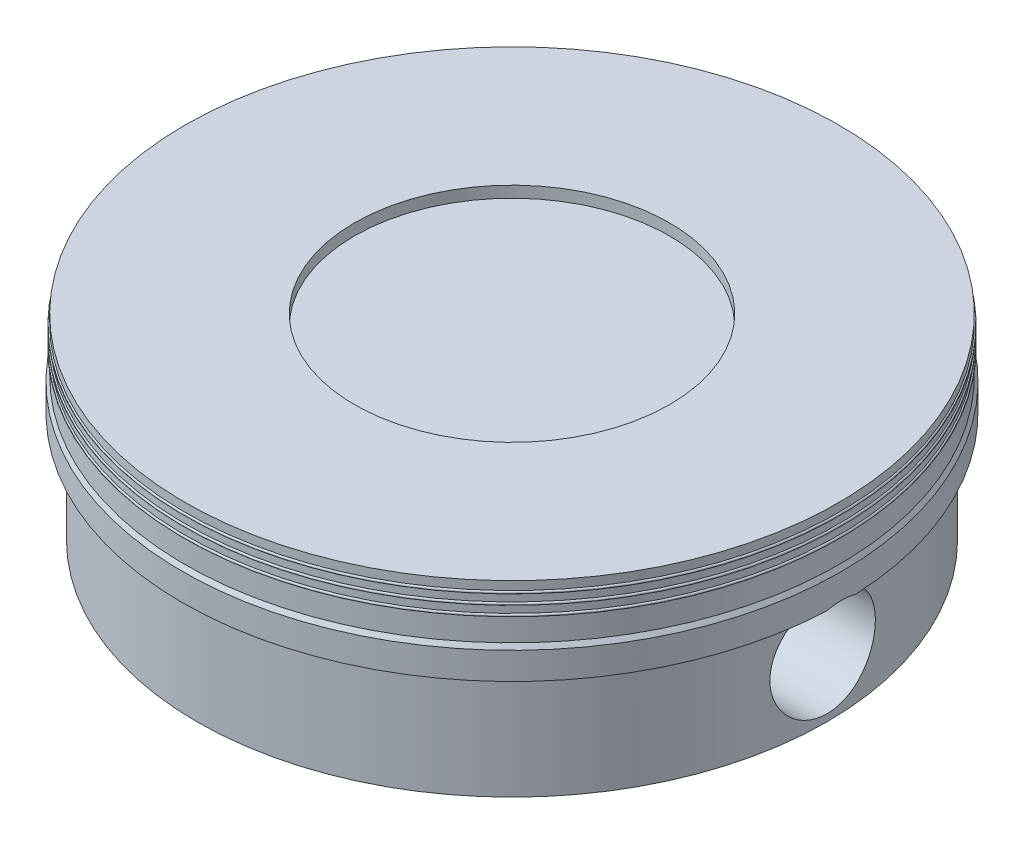
ISO-10303-21;
HEADER;
FILE_DESCRIPTION(('STEP AP214'),'2;1');
FILE_NAME('part.step','',(''),(''),'','','');
FILE_SCHEMA(('AUTOMOTIVE_DESIGN { 1 0 10303 214 1 1 1 1 }'));
ENDSEC;
DATA;
#1=APPLICATION_CONTEXT('core data for automotive mechanical design processes');
#2=APPLICATION_PROTOCOL_DEFINITION('international standard','automotive_design',2000,#1);
#3=PRODUCT_CONTEXT('',#1,'mechanical');
#4=PRODUCT('Part','Part','',(#3));
#5=PRODUCT_RELATED_PRODUCT_CATEGORY('part','',(#4));
#6=PRODUCT_DEFINITION_FORMATION('','',#4);
#7=PRODUCT_DEFINITION_CONTEXT('part definition',#1,'design');
#8=PRODUCT_DEFINITION('design','',#6,#7);
#9=PRODUCT_DEFINITION_SHAPE('','',#8);
#10=(LENGTH_UNIT() NAMED_UNIT(*) SI_UNIT(.MILLI.,.METRE.));
#11=(NAMED_UNIT(*) PLANE_ANGLE_UNIT() SI_UNIT($,.RADIAN.));
#12=(NAMED_UNIT(*) SI_UNIT($,.STERADIAN.) SOLID_ANGLE_UNIT());
#13=UNCERTAINTY_MEASURE_WITH_UNIT(LENGTH_MEASURE(1.E-05),#10,'distance_accuracy_value','');
#14=(GEOMETRIC_REPRESENTATION_CONTEXT(3) GLOBAL_UNCERTAINTY_ASSIGNED_CONTEXT((#13)) GLOBAL_UNIT_ASSIGNED_CONTEXT((#10,
#11,#12)) REPRESENTATION_CONTEXT('',''));
#15=CARTESIAN_POINT('',(0.,0.,0.));
#16=DIRECTION('',(0.,0.,1.));
#17=DIRECTION('',(1.,0.,0.));
#18=AXIS2_PLACEMENT_3D('',#15,#16,#17);
#19=CARTESIAN_POINT('',(5.,1.675,0.));
#20=DIRECTION('',(0.,1.,0.));
#21=DIRECTION('',(-1.,0.,0.));
#22=AXIS2_PLACEMENT_3D('',#19,#20,#21);
#23=PLANE('',#22);
#24=CARTESIAN_POINT('',(0.,1.675,0.));
#25=DIRECTION('',(0.,1.,0.));
#26=DIRECTION('',(-1.,0.,0.));
#27=AXIS2_PLACEMENT_3D('',#24,#25,#26);
#28=CIRCLE('',#27,5.);
#29=CARTESIAN_POINT('',(-4.99505678145904,1.675,0.222278541474428));
#30=VERTEX_POINT('',#29);
#31=CARTESIAN_POINT('',(4.99505678145904,1.675,0.222278541474428));
#32=VERTEX_POINT('',#31);
#33=EDGE_CURVE('E140',#30,#32,#28,.T.);
#34=ORIENTED_EDGE('',*,*,#33,.F.);
#35=DIRECTION('',(1.,0.,0.));
#36=VECTOR('',#35,1.);
#37=CARTESIAN_POINT('',(-5.,1.675,0.222278541474428));
#38=LINE('',#37,#36);
#39=CARTESIAN_POINT('',(-4.77482902835274,1.675,0.222278541474428));
#40=VERTEX_POINT('',#39);
#41=EDGE_CURVE('E123',#30,#40,#38,.T.);
#42=ORIENTED_EDGE('',*,*,#41,.T.);
#43=CARTESIAN_POINT('',(0.,1.675,0.));
#44=DIRECTION('',(0.,1.,0.));
#45=DIRECTION('',(-1.,0.,0.));
#46=AXIS2_PLACEMENT_3D('',#43,#44,#45);
#47=CIRCLE('',#46,4.78);
#48=CARTESIAN_POINT('',(4.77482902835274,1.675,0.222278541474428));
#49=VERTEX_POINT('',#48);
#50=EDGE_CURVE('E11',#40,#49,#47,.T.);
#51=ORIENTED_EDGE('',*,*,#50,.T.);
#52=EDGE_CURVE('E269',#49,#32,#38,.T.);
#53=ORIENTED_EDGE('',*,*,#52,.T.);
#54=EDGE_LOOP('',(#34,#42,#51,#53));
#55=FACE_BOUND('',#54,.T.);
#56=ADVANCED_FACE('F41',(#55),#23,.F.);
#57=CARTESIAN_POINT('',(0.,3.,0.));
#58=DIRECTION('',(0.,1.,0.));
#59=DIRECTION('',(-1.,0.,0.));
#60=AXIS2_PLACEMENT_3D('',#57,#58,#59);
#61=CYLINDRICAL_SURFACE('',#60,3.43);
#62=CARTESIAN_POINT('',(0.,1.93,0.));
#63=DIRECTION('',(0.,1.,0.));
#64=DIRECTION('',(-1.,0.,0.));
#65=AXIS2_PLACEMENT_3D('',#62,#63,#64);
#66=CIRCLE('',#65,3.43);
#67=CARTESIAN_POINT('',(-1.75,1.93,2.94998305079877));
#68=VERTEX_POINT('',#67);
#69=CARTESIAN_POINT('',(1.75,1.93,2.94998305079877));
#70=VERTEX_POINT('',#69);
#71=EDGE_CURVE('E196',#68,#70,#66,.T.);
#72=ORIENTED_EDGE('',*,*,#71,.T.);
#73=DIRECTION('',(0.,-1.,0.));
#74=VECTOR('',#73,1.);
#75=CARTESIAN_POINT('',(1.75,2.032,2.94998305079877));
#76=LINE('',#75,#74);
#77=CARTESIAN_POINT('',(1.75,0.,2.94998305079877));
#78=VERTEX_POINT('',#77);
#79=EDGE_CURVE('E256',#70,#78,#76,.T.);
#80=ORIENTED_EDGE('',*,*,#79,.T.);
#81=CARTESIAN_POINT('',(0.,0.,0.));
#82=DIRECTION('',(0.,1.,0.));
#83=DIRECTION('',(-1.,0.,0.));
#84=AXIS2_PLACEMENT_3D('',#81,#82,#83);
#85=CIRCLE('',#84,3.43);
#86=CARTESIAN_POINT('',(-1.75,0.,2.94998305079877));
#87=VERTEX_POINT('',#86);
#88=EDGE_CURVE('E201',#87,#78,#85,.T.);
#89=ORIENTED_EDGE('',*,*,#88,.F.);
#90=DIRECTION('',(0.,-1.,0.));
#91=VECTOR('',#90,1.);
#92=CARTESIAN_POINT('',(-1.75,2.032,2.94998305079877));
#93=LINE('',#92,#91);
#94=EDGE_CURVE('E223',#68,#87,#93,.T.);
#95=ORIENTED_EDGE('',*,*,#94,.F.);
#96=EDGE_LOOP('',(#72,#80,#89,#95));
#97=FACE_BOUND('',#96,.T.);
#98=ADVANCED_FACE('F311',(#97),#61,.F.);
#99=CARTESIAN_POINT('',(1.75,0.,-2.94998305079877));
#100=VERTEX_POINT('',#99);
#101=CARTESIAN_POINT('',(-1.75,0.,-2.94998305079877));
#102=VERTEX_POINT('',#101);
#103=EDGE_CURVE('E205',#100,#102,#85,.T.);
#104=ORIENTED_EDGE('',*,*,#103,.F.);
#105=DIRECTION('',(0.,-1.,0.));
#106=VECTOR('',#105,1.);
#107=CARTESIAN_POINT('',(1.75,2.032,-2.94998305079877));
#108=LINE('',#107,#106);
#109=CARTESIAN_POINT('',(1.75,1.93,-2.94998305079877));
#110=VERTEX_POINT('',#109);
#111=EDGE_CURVE('E255',#110,#100,#108,.T.);
#112=ORIENTED_EDGE('',*,*,#111,.F.);
#113=CARTESIAN_POINT('',(-1.75,1.93,-2.94998305079877));
#114=VERTEX_POINT('',#113);
#115=EDGE_CURVE('E200',#110,#114,#66,.T.);
#116=ORIENTED_EDGE('',*,*,#115,.T.);
#117=DIRECTION('',(0.,-1.,0.));
#118=VECTOR('',#117,1.);
#119=CARTESIAN_POINT('',(-1.75,2.032,-2.94998305079877));
#120=LINE('',#119,#118);
#121=EDGE_CURVE('E218',#114,#102,#120,.T.);
#122=ORIENTED_EDGE('',*,*,#121,.T.);
#123=EDGE_LOOP('',(#104,#112,#116,#122));
#124=FACE_BOUND('',#123,.T.);
#125=ADVANCED_FACE('F315',(#124),#61,.F.);
#126=CARTESIAN_POINT('',(0.,3.,0.));
#127=DIRECTION('',(0.,1.,0.));
#128=DIRECTION('',(-1.,0.,0.));
#129=AXIS2_PLACEMENT_3D('',#126,#127,#128);
#130=CYLINDRICAL_SURFACE('',#129,4.78);
#131=ORIENTED_EDGE('',*,*,#50,.F.);
#132=CARTESIAN_POINT('',(-4.77482902835274,1.675,0.222278541474428));
#133=CARTESIAN_POINT('',(-4.77283066428961,1.66251760040648,0.265565604349579));
#134=CARTESIAN_POINT('',(-4.77026122964184,1.64632518324707,0.30773073370543));
#135=CARTESIAN_POINT('',(-4.76433957684243,1.60716518046795,0.388679738433294));
#136=CARTESIAN_POINT('',(-4.76098813894914,1.58420434219223,0.427466931574521));
#137=CARTESIAN_POINT('',(-4.75385583560634,1.53212058152662,0.500619349341148));
#138=CARTESIAN_POINT('',(-4.75007489623267,1.50299659761285,0.534983810565069));
#139=CARTESIAN_POINT('',(-4.74250940084709,1.43940883049176,0.598349052768277));
#140=CARTESIAN_POINT('',(-4.73872484505611,1.40494535503943,0.627350142667719));
#141=CARTESIAN_POINT('',(-4.73155502519453,1.33141850948445,0.679324733736863));
#142=CARTESIAN_POINT('',(-4.72817200839428,1.2923314900543,0.702265117791889));
#143=CARTESIAN_POINT('',(-4.72221806324717,1.2107935026035,0.741247090151717));
#144=CARTESIAN_POINT('',(-4.71964718005436,1.16834234770334,0.75728829488487));
#145=CARTESIAN_POINT('',(-4.71563401927249,1.08161467189386,0.781889627588143));
#146=CARTESIAN_POINT('',(-4.71418348806761,1.0373540794988,0.790504520838059));
#147=CARTESIAN_POINT('',(-4.7125500070633,0.947995512716097,0.800185775280059));
#148=CARTESIAN_POINT('',(-4.71236689254088,0.902897647910612,0.801253117408922));
#149=CARTESIAN_POINT('',(-4.71328392928706,0.813698699588624,0.795840055019591));
#150=CARTESIAN_POINT('',(-4.71436921449282,0.769592121964982,0.789447089088825));
#151=CARTESIAN_POINT('',(-4.71767350699227,0.683088719044716,0.769453197548032));
#152=CARTESIAN_POINT('',(-4.71989255555964,0.64069195605305,0.75585200952822));
#153=CARTESIAN_POINT('',(-4.72521915045816,0.558683436475543,0.72180317819513));
#154=CARTESIAN_POINT('',(-4.7283288614316,0.519078761538392,0.701338833880693));
#155=CARTESIAN_POINT('',(-4.73508688186747,0.443840342660117,0.654154607876536));
#156=CARTESIAN_POINT('',(-4.73873523269645,0.408206904071829,0.627434245643699));
#157=CARTESIAN_POINT('',(-4.74621658524443,0.34144403910893,0.568094547648071));
#158=CARTESIAN_POINT('',(-4.75005134079569,0.310377397079155,0.535404762909897));
#159=CARTESIAN_POINT('',(-4.7574339496377,0.254152920801361,0.465256744709424));
#160=CARTESIAN_POINT('',(-4.76098179579358,0.228995233467963,0.42779839272171));
#161=CARTESIAN_POINT('',(-4.76740543112884,0.185232746655323,0.349013589957236));
#162=CARTESIAN_POINT('',(-4.77027898138976,0.166649676546708,0.307674873551614));
#163=CARTESIAN_POINT('',(-4.77501389912906,0.136709248813617,0.222404201513429));
#164=CARTESIAN_POINT('',(-4.77687534637364,0.125351321746849,0.17847245054655));
#165=CARTESIAN_POINT('',(-4.77936046311155,0.11029556587796,0.0897763188440884));
#166=CARTESIAN_POINT('',(-4.77999744806088,0.106515313829613,0.0450263004211174));
#167=CARTESIAN_POINT('',(-4.78000253603889,0.106484781177753,-0.0444748983796522));
#168=CARTESIAN_POINT('',(-4.77937070557894,0.110234105873413,-0.089226078573582));
#169=CARTESIAN_POINT('',(-4.77691933252607,0.125084268608638,-0.177083541545928));
#170=CARTESIAN_POINT('',(-4.77510939718632,0.136125651662481,-0.220200169792454));
#171=CARTESIAN_POINT('',(-4.77051005880234,0.165169748181614,-0.303965073132857));
#172=CARTESIAN_POINT('',(-4.7677206111178,0.183172778920872,-0.34461323562981));
#173=CARTESIAN_POINT('',(-4.76144347447166,0.225773031353335,-0.422610286132433));
#174=CARTESIAN_POINT('',(-4.7579509666563,0.250416183100952,-0.459933688698118));
#175=CARTESIAN_POINT('',(-4.7506628575762,0.305548870122429,-0.529946679139677));
#176=CARTESIAN_POINT('',(-4.74686723284706,0.336038858258292,-0.562635907738004));
#177=CARTESIAN_POINT('',(-4.73934595649031,0.402419024540191,-0.622842686258356));
#178=CARTESIAN_POINT('',(-4.73562161505293,0.438367377911769,-0.650296305894435));
#179=CARTESIAN_POINT('',(-4.72871063230577,0.514408879855222,-0.698783051779295));
#180=CARTESIAN_POINT('',(-4.7255239870653,0.554501998124278,-0.719816224964201));
#181=CARTESIAN_POINT('',(-4.72006047911231,0.637638983534412,-0.754813927505597));
#182=CARTESIAN_POINT('',(-4.71778200006854,0.680677447154729,-0.768791027013524));
#183=CARTESIAN_POINT('',(-4.71439384828623,0.768535211036556,-0.789303568970332));
#184=CARTESIAN_POINT('',(-4.71328404720934,0.813354315195972,-0.795839828541413));
#185=CARTESIAN_POINT('',(-4.71237032859513,0.90289480328276,-0.801232364030941));
#186=CARTESIAN_POINT('',(-4.71255007442033,0.947610255518896,-0.800184715236094));
#187=CARTESIAN_POINT('',(-4.71415581356403,1.03622268251501,-0.790669177264411));
#188=CARTESIAN_POINT('',(-4.71558184862927,1.08011962980736,-0.782201039524644));
#189=CARTESIAN_POINT('',(-4.7195083169912,1.16569262048708,-0.758147486013636));
#190=CARTESIAN_POINT('',(-4.72200485104165,1.20737611292669,-0.742587887767938));
#191=CARTESIAN_POINT('',(-4.72778974798997,1.28754614324109,-0.70481738944885));
#192=CARTESIAN_POINT('',(-4.73107806970195,1.32603284726103,-0.682606835319029));
#193=CARTESIAN_POINT('',(-4.73812137305509,1.39918330403427,-0.63187478229818));
#194=CARTESIAN_POINT('',(-4.74188110797214,1.43380013525124,-0.603286286080841));
#195=CARTESIAN_POINT('',(-4.7494215028626,1.49778166033869,-0.540730657504128));
#196=CARTESIAN_POINT('',(-4.75320216645441,1.52714541477425,-0.506762565127376));
#197=CARTESIAN_POINT('',(-4.76047823225014,1.58065809622249,-0.433176610453142));
#198=CARTESIAN_POINT('',(-4.76396027787699,1.6046052888986,-0.39341041320999));
#199=CARTESIAN_POINT('',(-4.77010780735379,1.64535476056296,-0.310255605256862));
#200=CARTESIAN_POINT('',(-4.77277226541471,1.66214807408118,-0.266862530175483));
#201=CARTESIAN_POINT('',(-4.77482902835274,1.675,-0.222278541474428));
#202=B_SPLINE_CURVE_WITH_KNOTS('',3,(#132,#133,#134,#135,#136,#137,#138,#139,#140,#141,#142,
#143,#144,#145,#146,#147,#148,#149,#150,#151,#152,#153,#154,#155,#156,#157,#158,#159,#160,#161,
#162,#163,#164,#165,#166,#167,#168,#169,#170,#171,#172,#173,#174,#175,#176,#177,#178,#179,#180,
#181,#182,#183,#184,#185,#186,#187,#188,#189,#190,#191,#192,#193,#194,#195,#196,#197,#198,#199,
#200,#201),.UNSPECIFIED.,.F.,.F.,(4,2,2,2,2,2,2,2,2,2,2,2,2,2,2,2,2,2,2,2,2,2,2,2,2,2,2,2,2,2,2,
2,2,2,4),(0.,0.135088002090542,0.270041789656699,0.405018840252152,0.539988113998977,
0.675680313048406,0.811380055162339,0.946070303482854,1.08074304611907,1.21385307747076,
1.34696795492373,1.48040913713283,1.61386057271599,1.74900279635995,1.88414837969582,
2.01973654129895,2.15531401533477,2.28940861700713,2.42349618961655,2.55650377224966,
2.68951741735821,2.82347585452539,2.95744467152932,3.09295713370618,3.22846860520704,
3.36373780819787,3.49899215505212,3.63253608442342,3.76608448726538,3.89915052374366,
4.032209640112,4.16673845047391,4.30129129532136,4.44024045581716,4.57936324317911),.UNSPECIFIED.);
#203=CARTESIAN_POINT('',(-4.77482902835274,1.675,-0.222278541474428));
#204=VERTEX_POINT('',#203);
#205=EDGE_CURVE('E292',#40,#204,#202,.T.);
#206=ORIENTED_EDGE('',*,*,#205,.T.);
#207=CARTESIAN_POINT('',(4.77482902835274,1.675,-0.222278541474428));
#208=VERTEX_POINT('',#207);
#209=EDGE_CURVE('E52',#208,#204,#47,.T.);
#210=ORIENTED_EDGE('',*,*,#209,.F.);
#211=CARTESIAN_POINT('',(4.77482902835274,1.675,-0.222278541474428));
#212=CARTESIAN_POINT('',(4.77283066428961,1.66251760040648,-0.265565604349579));
#213=CARTESIAN_POINT('',(4.77026122964184,1.64632518324707,-0.30773073370543));
#214=CARTESIAN_POINT('',(4.76433957684243,1.60716518046795,-0.388679738433294));
#215=CARTESIAN_POINT('',(4.76098813894914,1.58420434219223,-0.427466931574521));
#216=CARTESIAN_POINT('',(4.75385583560634,1.53212058152662,-0.500619349341148));
#217=CARTESIAN_POINT('',(4.75007489623267,1.50299659761285,-0.534983810565069));
#218=CARTESIAN_POINT('',(4.74250940084709,1.43940883049176,-0.598349052768277));
#219=CARTESIAN_POINT('',(4.73872484505611,1.40494535503943,-0.627350142667719));
#220=CARTESIAN_POINT('',(4.73155502519453,1.33141850948445,-0.679324733736863));
#221=CARTESIAN_POINT('',(4.72817200839428,1.2923314900543,-0.702265117791889));
#222=CARTESIAN_POINT('',(4.72221806324717,1.2107935026035,-0.741247090151717));
#223=CARTESIAN_POINT('',(4.71964718005436,1.16834234770334,-0.75728829488487));
#224=CARTESIAN_POINT('',(4.71563401927249,1.08161467189386,-0.781889627588143));
#225=CARTESIAN_POINT('',(4.71418348806761,1.0373540794988,-0.790504520838059));
#226=CARTESIAN_POINT('',(4.7125500070633,0.947995512716097,-0.800185775280059));
#227=CARTESIAN_POINT('',(4.71236689254088,0.902897647910612,-0.801253117408922));
#228=CARTESIAN_POINT('',(4.71328392928706,0.813698699588624,-0.795840055019591));
#229=CARTESIAN_POINT('',(4.71436921449282,0.769592121964982,-0.789447089088825));
#230=CARTESIAN_POINT('',(4.71767350699227,0.683088719044716,-0.769453197548032));
#231=CARTESIAN_POINT('',(4.71989255555964,0.64069195605305,-0.75585200952822));
#232=CARTESIAN_POINT('',(4.72521915045816,0.558683436475543,-0.72180317819513));
#233=CARTESIAN_POINT('',(4.7283288614316,0.519078761538392,-0.701338833880693));
#234=CARTESIAN_POINT('',(4.73508688186747,0.443840342660117,-0.654154607876536));
#235=CARTESIAN_POINT('',(4.73873523269645,0.408206904071829,-0.627434245643699));
#236=CARTESIAN_POINT('',(4.74621658524443,0.34144403910893,-0.568094547648071));
#237=CARTESIAN_POINT('',(4.75005134079569,0.310377397079155,-0.535404762909897));
#238=CARTESIAN_POINT('',(4.7574339496377,0.254152920801361,-0.465256744709424));
#239=CARTESIAN_POINT('',(4.76098179579358,0.228995233467963,-0.42779839272171));
#240=CARTESIAN_POINT('',(4.76740543112884,0.185232746655323,-0.349013589957236));
#241=CARTESIAN_POINT('',(4.77027898138976,0.166649676546708,-0.307674873551614));
#242=CARTESIAN_POINT('',(4.77501389912906,0.136709248813617,-0.222404201513429));
#243=CARTESIAN_POINT('',(4.77687534637364,0.125351321746849,-0.17847245054655));
#244=CARTESIAN_POINT('',(4.77936046311155,0.11029556587796,-0.0897763188440884));
#245=CARTESIAN_POINT('',(4.77999744806088,0.106515313829613,-0.0450263004211174));
#246=CARTESIAN_POINT('',(4.78000253603889,0.106484781177753,0.0444748983796522));
#247=CARTESIAN_POINT('',(4.77937070557894,0.110234105873413,0.089226078573582));
#248=CARTESIAN_POINT('',(4.77691933252607,0.125084268608638,0.177083541545928));
#249=CARTESIAN_POINT('',(4.77510939718632,0.136125651662481,0.220200169792454));
#250=CARTESIAN_POINT('',(4.77051005880234,0.165169748181614,0.303965073132857));
#251=CARTESIAN_POINT('',(4.7677206111178,0.183172778920872,0.34461323562981));
#252=CARTESIAN_POINT('',(4.76144347447166,0.225773031353335,0.422610286132433));
#253=CARTESIAN_POINT('',(4.7579509666563,0.250416183100952,0.459933688698118));
#254=CARTESIAN_POINT('',(4.7506628575762,0.305548870122429,0.529946679139677));
#255=CARTESIAN_POINT('',(4.74686723284706,0.336038858258292,0.562635907738004));
#256=CARTESIAN_POINT('',(4.73934595649031,0.402419024540191,0.622842686258356));
#257=CARTESIAN_POINT('',(4.73562161505293,0.438367377911769,0.650296305894435));
#258=CARTESIAN_POINT('',(4.72871063230577,0.514408879855222,0.698783051779295));
#259=CARTESIAN_POINT('',(4.7255239870653,0.554501998124278,0.719816224964201));
#260=CARTESIAN_POINT('',(4.72006047911231,0.637638983534412,0.754813927505597));
#261=CARTESIAN_POINT('',(4.71778200006854,0.680677447154729,0.768791027013524));
#262=CARTESIAN_POINT('',(4.71439384828623,0.768535211036556,0.789303568970332));
#263=CARTESIAN_POINT('',(4.71328404720934,0.813354315195972,0.795839828541413));
#264=CARTESIAN_POINT('',(4.71237032859513,0.90289480328276,0.801232364030941));
#265=CARTESIAN_POINT('',(4.71255007442033,0.947610255518896,0.800184715236094));
#266=CARTESIAN_POINT('',(4.71415581356403,1.03622268251501,0.790669177264411));
#267=CARTESIAN_POINT('',(4.71558184862927,1.08011962980736,0.782201039524644));
#268=CARTESIAN_POINT('',(4.7195083169912,1.16569262048708,0.758147486013636));
#269=CARTESIAN_POINT('',(4.72200485104165,1.20737611292669,0.742587887767938));
#270=CARTESIAN_POINT('',(4.72778974798997,1.28754614324109,0.70481738944885));
#271=CARTESIAN_POINT('',(4.73107806970195,1.32603284726103,0.682606835319029));
#272=CARTESIAN_POINT('',(4.73812137305509,1.39918330403427,0.63187478229818));
#273=CARTESIAN_POINT('',(4.74188110797214,1.43380013525124,0.603286286080841));
#274=CARTESIAN_POINT('',(4.7494215028626,1.49778166033869,0.540730657504128));
#275=CARTESIAN_POINT('',(4.75320216645441,1.52714541477425,0.506762565127376));
#276=CARTESIAN_POINT('',(4.76047823225014,1.58065809622249,0.433176610453142));
#277=CARTESIAN_POINT('',(4.76396027787699,1.6046052888986,0.39341041320999));
#278=CARTESIAN_POINT('',(4.77010780735379,1.64535476056296,0.310255605256862));
#279=CARTESIAN_POINT('',(4.77277226541471,1.66214807408118,0.266862530175483));
#280=CARTESIAN_POINT('',(4.77482902835274,1.675,0.222278541474428));
#281=B_SPLINE_CURVE_WITH_KNOTS('',3,(#211,#212,#213,#214,#215,#216,#217,#218,#219,#220,#221,
#222,#223,#224,#225,#226,#227,#228,#229,#230,#231,#232,#233,#234,#235,#236,#237,#238,#239,#240,
#241,#242,#243,#244,#245,#246,#247,#248,#249,#250,#251,#252,#253,#254,#255,#256,#257,#258,#259,
#260,#261,#262,#263,#264,#265,#266,#267,#268,#269,#270,#271,#272,#273,#274,#275,#276,#277,#278,
#279,#280),.UNSPECIFIED.,.F.,.F.,(4,2,2,2,2,2,2,2,2,2,2,2,2,2,2,2,2,2,2,2,2,2,2,2,2,2,2,2,2,2,2,
2,2,2,4),(0.,0.135088002090542,0.270041789656699,0.405018840252152,0.539988113998977,
0.675680313048406,0.811380055162339,0.946070303482854,1.08074304611907,1.21385307747076,
1.34696795492373,1.48040913713283,1.61386057271599,1.74900279635995,1.88414837969582,
2.01973654129895,2.15531401533477,2.28940861700713,2.42349618961655,2.55650377224966,
2.68951741735821,2.82347585452539,2.95744467152932,3.09295713370618,3.22846860520704,
3.36373780819787,3.49899215505212,3.63253608442342,3.76608448726538,3.89915052374366,
4.032209640112,4.16673845047391,4.30129129532136,4.44024045581716,4.57936324317911),.UNSPECIFIED.);
#282=EDGE_CURVE('E260',#208,#49,#281,.T.);
#283=ORIENTED_EDGE('',*,*,#282,.T.);
#284=EDGE_LOOP('',(#131,#206,#210,#283));
#285=FACE_BOUND('',#284,.T.);
#286=CARTESIAN_POINT('',(0.,0.,0.));
#287=DIRECTION('',(0.,1.,0.));
#288=DIRECTION('',(-1.,0.,0.));
#289=AXIS2_PLACEMENT_3D('',#286,#287,#288);
#290=CIRCLE('',#289,4.78);
#291=CARTESIAN_POINT('',(-4.78,0.,0.));
#292=VERTEX_POINT('',#291);
#293=EDGE_CURVE('E206',#292,#292,#290,.T.);
#294=ORIENTED_EDGE('',*,*,#293,.T.);
#295=EDGE_LOOP('',(#294));
#296=FACE_BOUND('',#295,.T.);
#297=ADVANCED_FACE('F43',(#285,#296),#130,.T.);
#298=CARTESIAN_POINT('',(4.99505678145904,1.675,-0.222278541474428));
#299=VERTEX_POINT('',#298);
#300=CARTESIAN_POINT('',(-4.99505678145904,1.675,-0.222278541474428));
#301=VERTEX_POINT('',#300);
#302=EDGE_CURVE('E133',#299,#301,#28,.T.);
#303=ORIENTED_EDGE('',*,*,#302,.F.);
#304=DIRECTION('',(1.,0.,0.));
#305=VECTOR('',#304,1.);
#306=CARTESIAN_POINT('',(-5.,1.675,-0.222278541474428));
#307=LINE('',#306,#305);
#308=EDGE_CURVE('E137',#299,#208,#307,.F.);
#309=ORIENTED_EDGE('',*,*,#308,.T.);
#310=ORIENTED_EDGE('',*,*,#209,.T.);
#311=EDGE_CURVE('E120',#204,#301,#307,.F.);
#312=ORIENTED_EDGE('',*,*,#311,.T.);
#313=EDGE_LOOP('',(#303,#309,#310,#312));
#314=FACE_BOUND('',#313,.T.);
#315=ADVANCED_FACE('F131',(#314),#23,.F.);
#316=CARTESIAN_POINT('',(0.,3.,0.));
#317=DIRECTION('',(0.,1.,0.));
#318=DIRECTION('',(-1.,0.,0.));
#319=AXIS2_PLACEMENT_3D('',#316,#317,#318);
#320=CYLINDRICAL_SURFACE('',#319,5.);
#321=CARTESIAN_POINT('',(0.,2.085,0.));
#322=DIRECTION('',(0.,1.,0.));
#323=DIRECTION('',(-1.,0.,0.));
#324=AXIS2_PLACEMENT_3D('',#321,#322,#323);
#325=CIRCLE('',#324,5.);
#326=CARTESIAN_POINT('',(-5.,2.085,0.));
#327=VERTEX_POINT('',#326);
#328=EDGE_CURVE('E141',#327,#327,#325,.T.);
#329=ORIENTED_EDGE('',*,*,#328,.F.);
#330=EDGE_LOOP('',(#329));
#331=FACE_BOUND('',#330,.T.);
#332=ORIENTED_EDGE('',*,*,#33,.T.);
#333=CARTESIAN_POINT('',(4.99505678145904,1.675,0.222278541474428));
#334=CARTESIAN_POINT('',(4.99601924166251,1.68125091408945,0.200664788927833));
#335=CARTESIAN_POINT('',(4.99685104595886,1.6865884492567,0.178793956916591));
#336=CARTESIAN_POINT('',(4.99823482678813,1.6954053697337,0.134667996610015));
#337=CARTESIAN_POINT('',(4.99878675033868,1.69888440322952,0.112412796376413));
#338=CARTESIAN_POINT('',(4.99997478933582,1.7063599701275,0.0463702196541047));
#339=CARTESIAN_POINT('',(5.00019162622722,1.70770103692501,0.00223735045870609));
#340=CARTESIAN_POINT('',(4.99957415116668,1.70383490135879,-0.0719867579957089));
#341=CARTESIAN_POINT('',(4.99904417676208,1.70052454174298,-0.102199597126166));
#342=CARTESIAN_POINT('',(4.99745094361179,1.69042173090497,-0.162537696499834));
#343=CARTESIAN_POINT('',(4.99637901057175,1.68357259963419,-0.192653245432489));
#344=CARTESIAN_POINT('',(4.99505678145904,1.675,-0.222278541474428));
#345=B_SPLINE_CURVE_WITH_KNOTS('',3,(#333,#334,#335,#336,#337,#338,#339,#340,#341,#342,#343,
#344),.UNSPECIFIED.,.F.,.F.,(4,2,2,2,2,4),(0.,0.0675150206754356,0.13504281740385,
0.266802474171201,0.357814439020074,0.450331522475724),.UNSPECIFIED.);
#346=EDGE_CURVE('E59',#32,#299,#345,.T.);
#347=ORIENTED_EDGE('',*,*,#346,.T.);
#348=ORIENTED_EDGE('',*,*,#302,.T.);
#349=CARTESIAN_POINT('',(-4.99505678145904,1.675,-0.222278541474428));
#350=CARTESIAN_POINT('',(-4.99601924166251,1.68125091408945,-0.200664788927833));
#351=CARTESIAN_POINT('',(-4.99685104595886,1.6865884492567,-0.178793956916591));
#352=CARTESIAN_POINT('',(-4.99823482678813,1.6954053697337,-0.134667996610015));
#353=CARTESIAN_POINT('',(-4.99878675033868,1.69888440322952,-0.112412796376413));
#354=CARTESIAN_POINT('',(-4.99997478933582,1.7063599701275,-0.0463702196541047));
#355=CARTESIAN_POINT('',(-5.00019162622722,1.70770103692501,-0.00223735045870609));
#356=CARTESIAN_POINT('',(-4.99957415116668,1.70383490135879,0.0719867579957089));
#357=CARTESIAN_POINT('',(-4.99904417676208,1.70052454174298,0.102199597126166));
#358=CARTESIAN_POINT('',(-4.99745094361179,1.69042173090497,0.162537696499834));
#359=CARTESIAN_POINT('',(-4.99637901057175,1.68357259963419,0.192653245432489));
#360=CARTESIAN_POINT('',(-4.99505678145904,1.675,0.222278541474428));
#361=B_SPLINE_CURVE_WITH_KNOTS('',3,(#349,#350,#351,#352,#353,#354,#355,#356,#357,#358,#359,
#360),.UNSPECIFIED.,.F.,.F.,(4,2,2,2,2,4),(0.,0.0675150206754356,0.13504281740385,
0.266802474171201,0.357814439020074,0.450331522475724),.UNSPECIFIED.);
#362=EDGE_CURVE('E64',#301,#30,#361,.T.);
#363=ORIENTED_EDGE('',*,*,#362,.T.);
#364=EDGE_LOOP('',(#332,#347,#348,#363));
#365=FACE_BOUND('',#364,.T.);
#366=ADVANCED_FACE('F138',(#331,#365),#320,.T.);
#367=CARTESIAN_POINT('',(0.,2.085,0.));
#368=DIRECTION('',(0.,-1.,0.));
#369=DIRECTION('',(1.,0.,0.));
#370=AXIS2_PLACEMENT_3D('',#367,#368,#369);
#371=CONICAL_SURFACE('',#370,5.,0.519146114246523);
#372=CARTESIAN_POINT('',(0.,2.155,0.));
#373=DIRECTION('',(0.,1.,0.));
#374=DIRECTION('',(-1.,0.,0.));
#375=AXIS2_PLACEMENT_3D('',#372,#373,#374);
#376=CIRCLE('',#375,4.96);
#377=CARTESIAN_POINT('',(-4.96,2.155,0.));
#378=VERTEX_POINT('',#377);
#379=EDGE_CURVE('E146',#378,#378,#376,.T.);
#380=ORIENTED_EDGE('',*,*,#379,.F.);
#381=EDGE_LOOP('',(#380));
#382=FACE_BOUND('',#381,.T.);
#383=ORIENTED_EDGE('',*,*,#328,.T.);
#384=EDGE_LOOP('',(#383));
#385=FACE_BOUND('',#384,.T.);
#386=ADVANCED_FACE('F323',(#382,#385),#371,.T.);
#387=CARTESIAN_POINT('',(0.,3.,0.));
#388=DIRECTION('',(0.,1.,0.));
#389=DIRECTION('',(-1.,0.,0.));
#390=AXIS2_PLACEMENT_3D('',#387,#388,#389);
#391=CYLINDRICAL_SURFACE('',#390,4.96);
#392=CARTESIAN_POINT('',(0.,2.502,0.));
#393=DIRECTION('',(0.,1.,0.));
#394=DIRECTION('',(-1.,0.,0.));
#395=AXIS2_PLACEMENT_3D('',#392,#393,#394);
#396=CIRCLE('',#395,4.96);
#397=CARTESIAN_POINT('',(-4.96,2.502,0.));
#398=VERTEX_POINT('',#397);
#399=EDGE_CURVE('E152',#398,#398,#396,.T.);
#400=ORIENTED_EDGE('',*,*,#399,.F.);
#401=EDGE_LOOP('',(#400));
#402=FACE_BOUND('',#401,.T.);
#403=ORIENTED_EDGE('',*,*,#379,.T.);
#404=EDGE_LOOP('',(#403));
#405=FACE_BOUND('',#404,.T.);
#406=ADVANCED_FACE('F383',(#402,#405),#391,.T.);
#407=CARTESIAN_POINT('',(0.,2.522,0.));
#408=DIRECTION('',(0.,1.,0.));
#409=DIRECTION('',(-1.,0.,0.));
#410=AXIS2_PLACEMENT_3D('',#407,#408,#409);
#411=TOROIDAL_SURFACE('',#410,4.96,0.0200000000000001);
#412=CARTESIAN_POINT('',(0.,2.542,0.));
#413=DIRECTION('',(0.,1.,0.));
#414=DIRECTION('',(-1.,0.,0.));
#415=AXIS2_PLACEMENT_3D('',#412,#413,#414);
#416=CIRCLE('',#415,4.96);
#417=CARTESIAN_POINT('',(-4.96,2.542,0.));
#418=VERTEX_POINT('',#417);
#419=EDGE_CURVE('E156',#418,#418,#416,.T.);
#420=ORIENTED_EDGE('',*,*,#419,.F.);
#421=EDGE_LOOP('',(#420));
#422=FACE_BOUND('',#421,.T.);
#423=ORIENTED_EDGE('',*,*,#399,.T.);
#424=EDGE_LOOP('',(#423));
#425=FACE_BOUND('',#424,.T.);
#426=ADVANCED_FACE('F379',(#422,#425),#411,.T.);
#427=CARTESIAN_POINT('',(0.,3.,0.));
#428=DIRECTION('',(0.,1.,0.));
#429=DIRECTION('',(-1.,0.,0.));
#430=AXIS2_PLACEMENT_3D('',#427,#428,#429);
#431=CYLINDRICAL_SURFACE('',#430,4.96);
#432=CARTESIAN_POINT('',(0.,2.652,0.));
#433=DIRECTION('',(0.,1.,0.));
#434=DIRECTION('',(-1.,0.,0.));
#435=AXIS2_PLACEMENT_3D('',#432,#433,#434);
#436=CIRCLE('',#435,4.96);
#437=CARTESIAN_POINT('',(-4.96,2.652,0.));
#438=VERTEX_POINT('',#437);
#439=EDGE_CURVE('E160',#438,#438,#436,.T.);
#440=ORIENTED_EDGE('',*,*,#439,.F.);
#441=EDGE_LOOP('',(#440));
#442=FACE_BOUND('',#441,.T.);
#443=ORIENTED_EDGE('',*,*,#419,.T.);
#444=EDGE_LOOP('',(#443));
#445=FACE_BOUND('',#444,.T.);
#446=ADVANCED_FACE('F375',(#442,#445),#431,.T.);
#447=CARTESIAN_POINT('',(0.,2.672,0.));
#448=DIRECTION('',(0.,1.,0.));
#449=DIRECTION('',(-1.,0.,0.));
#450=AXIS2_PLACEMENT_3D('',#447,#448,#449);
#451=TOROIDAL_SURFACE('',#450,4.96,0.0200000000000001);
#452=CARTESIAN_POINT('',(0.,2.692,0.));
#453=DIRECTION('',(0.,1.,0.));
#454=DIRECTION('',(-1.,0.,0.));
#455=AXIS2_PLACEMENT_3D('',#452,#453,#454);
#456=CIRCLE('',#455,4.96);
#457=CARTESIAN_POINT('',(-4.96,2.692,0.));
#458=VERTEX_POINT('',#457);
#459=EDGE_CURVE('E164',#458,#458,#456,.T.);
#460=ORIENTED_EDGE('',*,*,#459,.F.);
#461=EDGE_LOOP('',(#460));
#462=FACE_BOUND('',#461,.T.);
#463=ORIENTED_EDGE('',*,*,#439,.T.);
#464=EDGE_LOOP('',(#463));
#465=FACE_BOUND('',#464,.T.);
#466=ADVANCED_FACE('F371',(#462,#465),#451,.T.);
#467=CARTESIAN_POINT('',(0.,3.,0.));
#468=DIRECTION('',(0.,1.,0.));
#469=DIRECTION('',(-1.,0.,0.));
#470=AXIS2_PLACEMENT_3D('',#467,#468,#469);
#471=CYLINDRICAL_SURFACE('',#470,4.96);
#472=CARTESIAN_POINT('',(0.,2.802,0.));
#473=DIRECTION('',(0.,1.,0.));
#474=DIRECTION('',(-1.,0.,0.));
#475=AXIS2_PLACEMENT_3D('',#472,#473,#474);
#476=CIRCLE('',#475,4.96);
#477=CARTESIAN_POINT('',(-4.96,2.802,0.));
#478=VERTEX_POINT('',#477);
#479=EDGE_CURVE('E168',#478,#478,#476,.T.);
#480=ORIENTED_EDGE('',*,*,#479,.F.);
#481=EDGE_LOOP('',(#480));
#482=FACE_BOUND('',#481,.T.);
#483=ORIENTED_EDGE('',*,*,#459,.T.);
#484=EDGE_LOOP('',(#483));
#485=FACE_BOUND('',#484,.T.);
#486=ADVANCED_FACE('F367',(#482,#485),#471,.T.);
#487=CARTESIAN_POINT('',(0.,2.822,0.));
#488=DIRECTION('',(0.,1.,0.));
#489=DIRECTION('',(-1.,0.,0.));
#490=AXIS2_PLACEMENT_3D('',#487,#488,#489);
#491=TOROIDAL_SURFACE('',#490,4.96,0.0200000000000001);
#492=CARTESIAN_POINT('',(0.,2.842,0.));
#493=DIRECTION('',(0.,1.,0.));
#494=DIRECTION('',(-1.,0.,0.));
#495=AXIS2_PLACEMENT_3D('',#492,#493,#494);
#496=CIRCLE('',#495,4.96);
#497=CARTESIAN_POINT('',(-4.96,2.842,0.));
#498=VERTEX_POINT('',#497);
#499=EDGE_CURVE('E172',#498,#498,#496,.T.);
#500=ORIENTED_EDGE('',*,*,#499,.F.);
#501=EDGE_LOOP('',(#500));
#502=FACE_BOUND('',#501,.T.);
#503=ORIENTED_EDGE('',*,*,#479,.T.);
#504=EDGE_LOOP('',(#503));
#505=FACE_BOUND('',#504,.T.);
#506=ADVANCED_FACE('F363',(#502,#505),#491,.T.);
#507=CARTESIAN_POINT('',(0.,3.,0.));
#508=DIRECTION('',(0.,1.,0.));
#509=DIRECTION('',(-1.,0.,0.));
#510=AXIS2_PLACEMENT_3D('',#507,#508,#509);
#511=CYLINDRICAL_SURFACE('',#510,4.96);
#512=CARTESIAN_POINT('',(0.,2.972,0.));
#513=DIRECTION('',(0.,1.,0.));
#514=DIRECTION('',(-1.,0.,0.));
#515=AXIS2_PLACEMENT_3D('',#512,#513,#514);
#516=CIRCLE('',#515,4.96);
#517=CARTESIAN_POINT('',(-4.96,2.972,0.));
#518=VERTEX_POINT('',#517);
#519=EDGE_CURVE('E176',#518,#518,#516,.T.);
#520=ORIENTED_EDGE('',*,*,#519,.F.);
#521=EDGE_LOOP('',(#520));
#522=FACE_BOUND('',#521,.T.);
#523=ORIENTED_EDGE('',*,*,#499,.T.);
#524=EDGE_LOOP('',(#523));
#525=FACE_BOUND('',#524,.T.);
#526=ADVANCED_FACE('F359',(#522,#525),#511,.T.);
#527=CARTESIAN_POINT('',(2.39,2.972,0.));
#528=DIRECTION('',(0.,-1.,0.));
#529=DIRECTION('',(1.,0.,0.));
#530=AXIS2_PLACEMENT_3D('',#527,#528,#529);
#531=PLANE('',#530);
#532=CARTESIAN_POINT('',(0.,2.972,0.));
#533=DIRECTION('',(0.,1.,0.));
#534=DIRECTION('',(-1.,0.,0.));
#535=AXIS2_PLACEMENT_3D('',#532,#533,#534);
#536=CIRCLE('',#535,2.39);
#537=CARTESIAN_POINT('',(-2.39,2.972,0.));
#538=VERTEX_POINT('',#537);
#539=EDGE_CURVE('E180',#538,#538,#536,.T.);
#540=ORIENTED_EDGE('',*,*,#539,.F.);
#541=EDGE_LOOP('',(#540));
#542=FACE_BOUND('',#541,.T.);
#543=ORIENTED_EDGE('',*,*,#519,.T.);
#544=EDGE_LOOP('',(#543));
#545=FACE_BOUND('',#544,.T.);
#546=ADVANCED_FACE('F355',(#542,#545),#531,.F.);
#547=CARTESIAN_POINT('',(0.,3.,0.));
#548=DIRECTION('',(0.,1.,0.));
#549=DIRECTION('',(-1.,0.,0.));
#550=AXIS2_PLACEMENT_3D('',#547,#548,#549);
#551=CYLINDRICAL_SURFACE('',#550,2.39);
#552=CARTESIAN_POINT('',(0.,2.8,0.));
#553=DIRECTION('',(0.,1.,0.));
#554=DIRECTION('',(-1.,0.,0.));
#555=AXIS2_PLACEMENT_3D('',#552,#553,#554);
#556=CIRCLE('',#555,2.39);
#557=CARTESIAN_POINT('',(-2.39,2.8,0.));
#558=VERTEX_POINT('',#557);
#559=EDGE_CURVE('E184',#558,#558,#556,.T.);
#560=ORIENTED_EDGE('',*,*,#559,.F.);
#561=EDGE_LOOP('',(#560));
#562=FACE_BOUND('',#561,.T.);
#563=ORIENTED_EDGE('',*,*,#539,.T.);
#564=EDGE_LOOP('',(#563));
#565=FACE_BOUND('',#564,.T.);
#566=ADVANCED_FACE('F351',(#562,#565),#551,.F.);
#567=CARTESIAN_POINT('',(0.,2.8,0.));
#568=DIRECTION('',(0.,-1.,0.));
#569=DIRECTION('',(1.,0.,0.));
#570=AXIS2_PLACEMENT_3D('',#567,#568,#569);
#571=PLANE('',#570);
#572=ORIENTED_EDGE('',*,*,#559,.T.);
#573=EDGE_LOOP('',(#572));
#574=FACE_BOUND('',#573,.T.);
#575=ADVANCED_FACE('F347',(#574),#571,.F.);
#576=CARTESIAN_POINT('',(4.2,2.33,0.));
#577=DIRECTION('',(0.,1.,0.));
#578=DIRECTION('',(-1.,0.,0.));
#579=AXIS2_PLACEMENT_3D('',#576,#577,#578);
#580=PLANE('',#579);
#581=CARTESIAN_POINT('',(0.,2.33,0.));
#582=DIRECTION('',(0.,1.,0.));
#583=DIRECTION('',(-1.,0.,0.));
#584=AXIS2_PLACEMENT_3D('',#581,#582,#583);
#585=CIRCLE('',#584,4.2);
#586=CARTESIAN_POINT('',(-4.2,2.33,0.));
#587=VERTEX_POINT('',#586);
#588=EDGE_CURVE('E188',#587,#587,#585,.T.);
#589=ORIENTED_EDGE('',*,*,#588,.F.);
#590=EDGE_LOOP('',(#589));
#591=FACE_BOUND('',#590,.T.);
#592=ADVANCED_FACE('F343',(#591),#580,.F.);
#593=CARTESIAN_POINT('',(0.,3.,0.));
#594=DIRECTION('',(0.,1.,0.));
#595=DIRECTION('',(-1.,0.,0.));
#596=AXIS2_PLACEMENT_3D('',#593,#594,#595);
#597=CYLINDRICAL_SURFACE('',#596,4.2);
#598=CARTESIAN_POINT('',(0.,1.93,0.));
#599=DIRECTION('',(0.,1.,0.));
#600=DIRECTION('',(-1.,0.,0.));
#601=AXIS2_PLACEMENT_3D('',#598,#599,#600);
#602=CIRCLE('',#601,4.2);
#603=CARTESIAN_POINT('',(-4.2,1.93,0.));
#604=VERTEX_POINT('',#603);
#605=EDGE_CURVE('E192',#604,#604,#602,.T.);
#606=ORIENTED_EDGE('',*,*,#605,.F.);
#607=EDGE_LOOP('',(#606));
#608=FACE_BOUND('',#607,.T.);
#609=ORIENTED_EDGE('',*,*,#588,.T.);
#610=EDGE_LOOP('',(#609));
#611=FACE_BOUND('',#610,.T.);
#612=ADVANCED_FACE('F339',(#608,#611),#597,.F.);
#613=CARTESIAN_POINT('',(3.43,1.93,0.));
#614=DIRECTION('',(0.,-1.,0.));
#615=DIRECTION('',(1.,0.,0.));
#616=AXIS2_PLACEMENT_3D('',#613,#614,#615);
#617=PLANE('',#616);
#618=ORIENTED_EDGE('',*,*,#71,.F.);
#619=CARTESIAN_POINT('',(0.,1.93,0.));
#620=DIRECTION('',(0.,-1.,0.));
#621=DIRECTION('',(1.,0.,0.));
#622=AXIS2_PLACEMENT_3D('',#619,#620,#621);
#623=CIRCLE('',#622,3.43);
#624=EDGE_CURVE('E210',#68,#114,#623,.T.);
#625=ORIENTED_EDGE('',*,*,#624,.T.);
#626=ORIENTED_EDGE('',*,*,#115,.F.);
#627=CARTESIAN_POINT('',(0.,1.93,0.));
#628=DIRECTION('',(0.,-1.,0.));
#629=DIRECTION('',(1.,0.,0.));
#630=AXIS2_PLACEMENT_3D('',#627,#628,#629);
#631=CIRCLE('',#630,3.43);
#632=EDGE_CURVE('E229',#110,#70,#631,.T.);
#633=ORIENTED_EDGE('',*,*,#632,.T.);
#634=EDGE_LOOP('',(#618,#625,#626,#633));
#635=FACE_BOUND('',#634,.T.);
#636=ORIENTED_EDGE('',*,*,#605,.T.);
#637=EDGE_LOOP('',(#636));
#638=FACE_BOUND('',#637,.T.);
#639=ADVANCED_FACE('F336',(#635,#638),#617,.F.);
#640=CARTESIAN_POINT('',(4.78,0.,0.));
#641=DIRECTION('',(0.,1.,0.));
#642=DIRECTION('',(-1.,0.,0.));
#643=AXIS2_PLACEMENT_3D('',#640,#641,#642);
#644=PLANE('',#643);
#645=ORIENTED_EDGE('',*,*,#293,.F.);
#646=EDGE_LOOP('',(#645));
#647=FACE_BOUND('',#646,.T.);
#648=ORIENTED_EDGE('',*,*,#88,.T.);
#649=DIRECTION('',(0.,0.,-1.));
#650=VECTOR('',#649,1.);
#651=CARTESIAN_POINT('',(1.75,0.,2.94998305079877));
#652=LINE('',#651,#650);
#653=EDGE_CURVE('E239',#78,#100,#652,.T.);
#654=ORIENTED_EDGE('',*,*,#653,.T.);
#655=ORIENTED_EDGE('',*,*,#103,.T.);
#656=DIRECTION('',(0.,0.,-1.));
#657=VECTOR('',#656,1.);
#658=CARTESIAN_POINT('',(-1.75,0.,2.94998305079877));
#659=LINE('',#658,#657);
#660=EDGE_CURVE('E224',#87,#102,#659,.T.);
#661=ORIENTED_EDGE('',*,*,#660,.F.);
#662=EDGE_LOOP('',(#648,#654,#655,#661));
#663=FACE_BOUND('',#662,.T.);
#664=ADVANCED_FACE('F334',(#647,#663),#644,.F.);
#665=CARTESIAN_POINT('',(0.,2.032,0.));
#666=DIRECTION('',(0.,-1.,0.));
#667=DIRECTION('',(1.,0.,0.));
#668=AXIS2_PLACEMENT_3D('',#665,#666,#667);
#669=CYLINDRICAL_SURFACE('',#668,3.43);
#670=ORIENTED_EDGE('',*,*,#624,.F.);
#671=CARTESIAN_POINT('',(-1.75,2.032,2.94998305079877));
#672=VERTEX_POINT('',#671);
#673=EDGE_CURVE('E219',#672,#68,#93,.T.);
#674=ORIENTED_EDGE('',*,*,#673,.F.);
#675=CARTESIAN_POINT('',(0.,2.032,0.));
#676=DIRECTION('',(0.,-1.,0.));
#677=DIRECTION('',(1.,0.,0.));
#678=AXIS2_PLACEMENT_3D('',#675,#676,#677);
#679=CIRCLE('',#678,3.43);
#680=CARTESIAN_POINT('',(-1.75,2.032,-2.94998305079877));
#681=VERTEX_POINT('',#680);
#682=EDGE_CURVE('E230',#672,#681,#679,.T.);
#683=ORIENTED_EDGE('',*,*,#682,.T.);
#684=EDGE_CURVE('E214',#681,#114,#120,.T.);
#685=ORIENTED_EDGE('',*,*,#684,.T.);
#686=EDGE_LOOP('',(#670,#674,#683,#685));
#687=FACE_BOUND('',#686,.T.);
#688=ADVANCED_FACE('F460',(#687),#669,.T.);
#689=CARTESIAN_POINT('',(-1.75,2.032,2.94998305079877));
#690=DIRECTION('',(-1.,0.,0.));
#691=DIRECTION('',(0.,-1.,0.));
#692=AXIS2_PLACEMENT_3D('',#689,#690,#691);
#693=PLANE('',#692);
#694=CARTESIAN_POINT('',(-1.75,0.9065,0.));
#695=DIRECTION('',(-1.,0.,0.));
#696=DIRECTION('',(0.,-1.,0.));
#697=AXIS2_PLACEMENT_3D('',#694,#695,#696);
#698=CIRCLE('',#697,0.8);
#699=CARTESIAN_POINT('',(-1.75,0.1065,0.));
#700=VERTEX_POINT('',#699);
#701=EDGE_CURVE('E126',#700,#700,#698,.T.);
#702=ORIENTED_EDGE('',*,*,#701,.T.);
#703=EDGE_LOOP('',(#702));
#704=FACE_BOUND('',#703,.T.);
#705=ORIENTED_EDGE('',*,*,#660,.T.);
#706=ORIENTED_EDGE('',*,*,#121,.F.);
#707=ORIENTED_EDGE('',*,*,#684,.F.);
#708=DIRECTION('',(0.,0.,-1.));
#709=VECTOR('',#708,1.);
#710=CARTESIAN_POINT('',(-1.75,2.032,2.94998305079877));
#711=LINE('',#710,#709);
#712=EDGE_CURVE('E228',#672,#681,#711,.T.);
#713=ORIENTED_EDGE('',*,*,#712,.F.);
#714=ORIENTED_EDGE('',*,*,#673,.T.);
#715=ORIENTED_EDGE('',*,*,#94,.T.);
#716=EDGE_LOOP('',(#705,#706,#707,#713,#714,#715));
#717=FACE_BOUND('',#716,.T.);
#718=ADVANCED_FACE('F467',(#704,#717),#693,.F.);
#719=CARTESIAN_POINT('',(0.,2.032,0.));
#720=DIRECTION('',(0.,-1.,0.));
#721=DIRECTION('',(1.,0.,0.));
#722=AXIS2_PLACEMENT_3D('',#719,#720,#721);
#723=PLANE('',#722);
#724=ORIENTED_EDGE('',*,*,#712,.T.);
#725=ORIENTED_EDGE('',*,*,#682,.F.);
#726=EDGE_LOOP('',(#724,#725));
#727=FACE_BOUND('',#726,.T.);
#728=ADVANCED_FACE('F476',(#727),#723,.F.);
#729=CARTESIAN_POINT('',(0.,2.032,0.));
#730=DIRECTION('',(0.,-1.,0.));
#731=DIRECTION('',(1.,0.,0.));
#732=AXIS2_PLACEMENT_3D('',#729,#730,#731);
#733=CYLINDRICAL_SURFACE('',#732,3.43);
#734=ORIENTED_EDGE('',*,*,#632,.F.);
#735=CARTESIAN_POINT('',(1.75,2.032,-2.94998305079877));
#736=VERTEX_POINT('',#735);
#737=EDGE_CURVE('E248',#736,#110,#108,.T.);
#738=ORIENTED_EDGE('',*,*,#737,.F.);
#739=CARTESIAN_POINT('',(0.,2.032,0.));
#740=DIRECTION('',(0.,-1.,0.));
#741=DIRECTION('',(1.,0.,0.));
#742=AXIS2_PLACEMENT_3D('',#739,#740,#741);
#743=CIRCLE('',#742,3.43);
#744=CARTESIAN_POINT('',(1.75,2.032,2.94998305079877));
#745=VERTEX_POINT('',#744);
#746=EDGE_CURVE('E244',#736,#745,#743,.T.);
#747=ORIENTED_EDGE('',*,*,#746,.T.);
#748=EDGE_CURVE('E251',#745,#70,#76,.T.);
#749=ORIENTED_EDGE('',*,*,#748,.T.);
#750=EDGE_LOOP('',(#734,#738,#747,#749));
#751=FACE_BOUND('',#750,.T.);
#752=ADVANCED_FACE('F483',(#751),#733,.T.);
#753=CARTESIAN_POINT('',(1.75,2.032,2.94998305079877));
#754=DIRECTION('',(-1.,0.,0.));
#755=DIRECTION('',(0.,-1.,0.));
#756=AXIS2_PLACEMENT_3D('',#753,#754,#755);
#757=PLANE('',#756);
#758=CARTESIAN_POINT('',(1.75,0.9065,0.));
#759=DIRECTION('',(-1.,0.,0.));
#760=DIRECTION('',(0.,-1.,0.));
#761=AXIS2_PLACEMENT_3D('',#758,#759,#760);
#762=CIRCLE('',#761,0.8);
#763=CARTESIAN_POINT('',(1.75,0.1065,0.));
#764=VERTEX_POINT('',#763);
#765=EDGE_CURVE('E46',#764,#764,#762,.T.);
#766=ORIENTED_EDGE('',*,*,#765,.F.);
#767=EDGE_LOOP('',(#766));
#768=FACE_BOUND('',#767,.T.);
#769=ORIENTED_EDGE('',*,*,#653,.F.);
#770=ORIENTED_EDGE('',*,*,#79,.F.);
#771=ORIENTED_EDGE('',*,*,#748,.F.);
#772=DIRECTION('',(0.,0.,-1.));
#773=VECTOR('',#772,1.);
#774=CARTESIAN_POINT('',(1.75,2.032,2.94998305079877));
#775=LINE('',#774,#773);
#776=EDGE_CURVE('E240',#745,#736,#775,.T.);
#777=ORIENTED_EDGE('',*,*,#776,.T.);
#778=ORIENTED_EDGE('',*,*,#737,.T.);
#779=ORIENTED_EDGE('',*,*,#111,.T.);
#780=EDGE_LOOP('',(#769,#770,#771,#777,#778,#779));
#781=FACE_BOUND('',#780,.T.);
#782=ADVANCED_FACE('F282',(#768,#781),#757,.T.);
#783=CARTESIAN_POINT('',(0.,2.032,0.));
#784=DIRECTION('',(0.,-1.,0.));
#785=DIRECTION('',(1.,0.,0.));
#786=AXIS2_PLACEMENT_3D('',#783,#784,#785);
#787=PLANE('',#786);
#788=ORIENTED_EDGE('',*,*,#776,.F.);
#789=ORIENTED_EDGE('',*,*,#746,.F.);
#790=EDGE_LOOP('',(#788,#789));
#791=FACE_BOUND('',#790,.T.);
#792=ADVANCED_FACE('F280',(#791),#787,.F.);
#793=CARTESIAN_POINT('',(-5.,0.9065,0.));
#794=DIRECTION('',(1.,0.,0.));
#795=DIRECTION('',(0.,0.,-1.));
#796=AXIS2_PLACEMENT_3D('',#793,#794,#795);
#797=CYLINDRICAL_SURFACE('',#796,0.8);
#798=ORIENTED_EDGE('',*,*,#765,.T.);
#799=EDGE_LOOP('',(#798));
#800=FACE_BOUND('',#799,.T.);
#801=ORIENTED_EDGE('',*,*,#308,.F.);
#802=ORIENTED_EDGE('',*,*,#346,.F.);
#803=ORIENTED_EDGE('',*,*,#52,.F.);
#804=ORIENTED_EDGE('',*,*,#282,.F.);
#805=EDGE_LOOP('',(#801,#802,#803,#804));
#806=FACE_BOUND('',#805,.T.);
#807=ADVANCED_FACE('F276',(#800,#806),#797,.F.);
#808=ORIENTED_EDGE('',*,*,#701,.F.);
#809=EDGE_LOOP('',(#808));
#810=FACE_BOUND('',#809,.T.);
#811=ORIENTED_EDGE('',*,*,#41,.F.);
#812=ORIENTED_EDGE('',*,*,#362,.F.);
#813=ORIENTED_EDGE('',*,*,#311,.F.);
#814=ORIENTED_EDGE('',*,*,#205,.F.);
#815=EDGE_LOOP('',(#811,#812,#813,#814));
#816=FACE_BOUND('',#815,.T.);
#817=ADVANCED_FACE('F119',(#810,#816),#797,.F.);
#818=CLOSED_SHELL('',(#56,#98,#125,#297,#315,#366,#386,#406,#426,#446,#466,#486,#506,#526,#546,
#566,#575,#592,#612,#639,#664,#688,#718,#728,#752,#782,#792,#807,#817));
#819=MANIFOLD_SOLID_BREP('B2',#818);
#820=ADVANCED_BREP_SHAPE_REPRESENTATION('',(#18,#819),#14);
#821=SHAPE_DEFINITION_REPRESENTATION(#9,#820);
ENDSEC;
END-ISO-10303-21;
